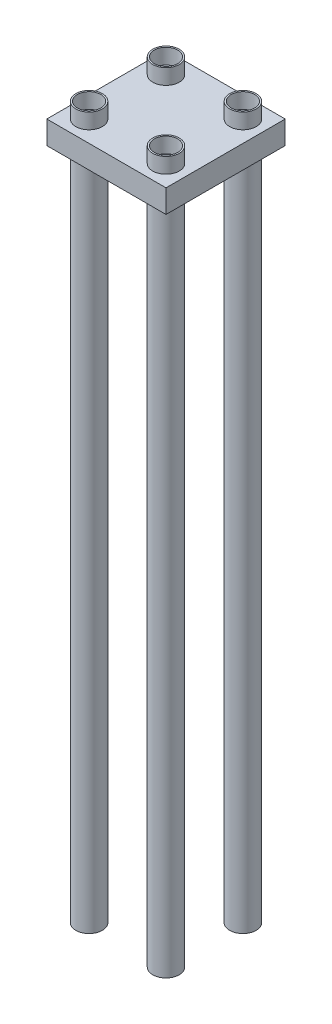
ISO-10303-21;
HEADER;
FILE_DESCRIPTION(('STEP AP214'),'2;1');
FILE_NAME('part.step','',(''),(''),'','','');
FILE_SCHEMA(('AUTOMOTIVE_DESIGN { 1 0 10303 214 1 1 1 1 }'));
ENDSEC;
DATA;
#1=APPLICATION_CONTEXT('core data for automotive mechanical design processes');
#2=APPLICATION_PROTOCOL_DEFINITION('international standard','automotive_design',2000,#1);
#3=PRODUCT_CONTEXT('',#1,'mechanical');
#4=PRODUCT('Part','Part','',(#3));
#5=PRODUCT_RELATED_PRODUCT_CATEGORY('part','',(#4));
#6=PRODUCT_DEFINITION_FORMATION('','',#4);
#7=PRODUCT_DEFINITION_CONTEXT('part definition',#1,'design');
#8=PRODUCT_DEFINITION('design','',#6,#7);
#9=PRODUCT_DEFINITION_SHAPE('','',#8);
#10=(LENGTH_UNIT() NAMED_UNIT(*) SI_UNIT(.MILLI.,.METRE.));
#11=(NAMED_UNIT(*) PLANE_ANGLE_UNIT() SI_UNIT($,.RADIAN.));
#12=(NAMED_UNIT(*) SI_UNIT($,.STERADIAN.) SOLID_ANGLE_UNIT());
#13=UNCERTAINTY_MEASURE_WITH_UNIT(LENGTH_MEASURE(1.E-05),#10,'distance_accuracy_value','');
#14=(GEOMETRIC_REPRESENTATION_CONTEXT(3) GLOBAL_UNCERTAINTY_ASSIGNED_CONTEXT((#13)) GLOBAL_UNIT_ASSIGNED_CONTEXT((#10,
#11,#12)) REPRESENTATION_CONTEXT('',''));
#15=CARTESIAN_POINT('',(0.,0.,0.));
#16=DIRECTION('',(0.,0.,1.));
#17=DIRECTION('',(1.,0.,0.));
#18=AXIS2_PLACEMENT_3D('',#15,#16,#17);
#19=CARTESIAN_POINT('',(1550.,500.,1500.));
#20=DIRECTION('',(-1.,0.,0.));
#21=DIRECTION('',(0.,0.,1.));
#22=AXIS2_PLACEMENT_3D('',#19,#20,#21);
#23=PLANE('',#22);
#24=DIRECTION('',(0.,0.,-1.));
#25=VECTOR('',#24,1.);
#26=CARTESIAN_POINT('',(1550.,-50.,0.));
#27=LINE('',#26,#25);
#28=CARTESIAN_POINT('',(1550.,-50.,1550.));
#29=VERTEX_POINT('',#28);
#30=CARTESIAN_POINT('',(1550.,-50.,-1550.));
#31=VERTEX_POINT('',#30);
#32=EDGE_CURVE('E132',#29,#31,#27,.T.);
#33=ORIENTED_EDGE('',*,*,#32,.T.);
#34=DIRECTION('',(0.,-1.,0.));
#35=VECTOR('',#34,1.);
#36=CARTESIAN_POINT('',(1550.,500.,-1550.));
#37=LINE('',#36,#35);
#38=CARTESIAN_POINT('',(1550.,550.,-1550.));
#39=VERTEX_POINT('',#38);
#40=EDGE_CURVE('E135',#39,#31,#37,.T.);
#41=ORIENTED_EDGE('',*,*,#40,.F.);
#42=DIRECTION('',(0.,0.,-1.));
#43=VECTOR('',#42,1.);
#44=CARTESIAN_POINT('',(1550.,550.,0.));
#45=LINE('',#44,#43);
#46=CARTESIAN_POINT('',(1550.,550.,1550.));
#47=VERTEX_POINT('',#46);
#48=EDGE_CURVE('E152',#47,#39,#45,.T.);
#49=ORIENTED_EDGE('',*,*,#48,.F.);
#50=DIRECTION('',(0.,-1.,0.));
#51=VECTOR('',#50,1.);
#52=CARTESIAN_POINT('',(1550.,500.,1550.));
#53=LINE('',#52,#51);
#54=EDGE_CURVE('E143',#47,#29,#53,.T.);
#55=ORIENTED_EDGE('',*,*,#54,.T.);
#56=EDGE_LOOP('',(#33,#41,#49,#55));
#57=FACE_BOUND('',#56,.T.);
#58=ADVANCED_FACE('F38',(#57),#23,.F.);
#59=CARTESIAN_POINT('',(-1500.,500.,-1550.));
#60=DIRECTION('',(0.,0.,1.));
#61=DIRECTION('',(1.,0.,0.));
#62=AXIS2_PLACEMENT_3D('',#59,#60,#61);
#63=PLANE('',#62);
#64=DIRECTION('',(-1.,0.,0.));
#65=VECTOR('',#64,1.);
#66=CARTESIAN_POINT('',(0.,-50.,-1550.));
#67=LINE('',#66,#65);
#68=CARTESIAN_POINT('',(-1550.,-50.,-1550.));
#69=VERTEX_POINT('',#68);
#70=EDGE_CURVE('E126',#31,#69,#67,.T.);
#71=ORIENTED_EDGE('',*,*,#70,.T.);
#72=DIRECTION('',(0.,-1.,0.));
#73=VECTOR('',#72,1.);
#74=CARTESIAN_POINT('',(-1550.,500.,-1550.));
#75=LINE('',#74,#73);
#76=CARTESIAN_POINT('',(-1550.,550.,-1550.));
#77=VERTEX_POINT('',#76);
#78=EDGE_CURVE('E141',#77,#69,#75,.T.);
#79=ORIENTED_EDGE('',*,*,#78,.F.);
#80=DIRECTION('',(-1.,0.,0.));
#81=VECTOR('',#80,1.);
#82=CARTESIAN_POINT('',(0.,550.,-1550.));
#83=LINE('',#82,#81);
#84=EDGE_CURVE('E137',#39,#77,#83,.T.);
#85=ORIENTED_EDGE('',*,*,#84,.F.);
#86=ORIENTED_EDGE('',*,*,#40,.T.);
#87=EDGE_LOOP('',(#71,#79,#85,#86));
#88=FACE_BOUND('',#87,.T.);
#89=ADVANCED_FACE('F136',(#88),#63,.F.);
#90=CARTESIAN_POINT('',(-1550.,500.,1500.));
#91=DIRECTION('',(1.,0.,0.));
#92=DIRECTION('',(0.,0.,-1.));
#93=AXIS2_PLACEMENT_3D('',#90,#91,#92);
#94=PLANE('',#93);
#95=DIRECTION('',(0.,0.,1.));
#96=VECTOR('',#95,1.);
#97=CARTESIAN_POINT('',(-1550.,-50.,0.));
#98=LINE('',#97,#96);
#99=CARTESIAN_POINT('',(-1550.,-50.,1550.));
#100=VERTEX_POINT('',#99);
#101=EDGE_CURVE('E118',#69,#100,#98,.T.);
#102=ORIENTED_EDGE('',*,*,#101,.T.);
#103=DIRECTION('',(0.,-1.,0.));
#104=VECTOR('',#103,1.);
#105=CARTESIAN_POINT('',(-1550.,500.,1550.));
#106=LINE('',#105,#104);
#107=CARTESIAN_POINT('',(-1550.,550.,1550.));
#108=VERTEX_POINT('',#107);
#109=EDGE_CURVE('E154',#108,#100,#106,.T.);
#110=ORIENTED_EDGE('',*,*,#109,.F.);
#111=DIRECTION('',(0.,0.,1.));
#112=VECTOR('',#111,1.);
#113=CARTESIAN_POINT('',(-1550.,550.,0.));
#114=LINE('',#113,#112);
#115=EDGE_CURVE('E98',#77,#108,#114,.T.);
#116=ORIENTED_EDGE('',*,*,#115,.F.);
#117=ORIENTED_EDGE('',*,*,#78,.T.);
#118=EDGE_LOOP('',(#102,#110,#116,#117));
#119=FACE_BOUND('',#118,.T.);
#120=ADVANCED_FACE('F383',(#119),#94,.F.);
#121=CARTESIAN_POINT('',(-1500.,500.,1550.));
#122=DIRECTION('',(0.,0.,-1.));
#123=DIRECTION('',(-1.,0.,0.));
#124=AXIS2_PLACEMENT_3D('',#121,#122,#123);
#125=PLANE('',#124);
#126=DIRECTION('',(1.,0.,0.));
#127=VECTOR('',#126,1.);
#128=CARTESIAN_POINT('',(0.,-50.,1550.));
#129=LINE('',#128,#127);
#130=EDGE_CURVE('E109',#100,#29,#129,.T.);
#131=ORIENTED_EDGE('',*,*,#130,.T.);
#132=ORIENTED_EDGE('',*,*,#54,.F.);
#133=DIRECTION('',(1.,0.,0.));
#134=VECTOR('',#133,1.);
#135=CARTESIAN_POINT('',(0.,550.,1550.));
#136=LINE('',#135,#134);
#137=EDGE_CURVE('E92',#108,#47,#136,.T.);
#138=ORIENTED_EDGE('',*,*,#137,.F.);
#139=ORIENTED_EDGE('',*,*,#109,.T.);
#140=EDGE_LOOP('',(#131,#132,#138,#139));
#141=FACE_BOUND('',#140,.T.);
#142=ADVANCED_FACE('F377',(#141),#125,.F.);
#143=CARTESIAN_POINT('',(0.,550.,0.));
#144=DIRECTION('',(0.,-1.,0.));
#145=DIRECTION('',(0.,0.,-1.));
#146=AXIS2_PLACEMENT_3D('',#143,#144,#145);
#147=PLANE('',#146);
#148=CARTESIAN_POINT('',(1000.,550.000000000001,1000.));
#149=DIRECTION('',(0.,-1.,0.));
#150=DIRECTION('',(0.,0.,-1.));
#151=AXIS2_PLACEMENT_3D('',#148,#149,#150);
#152=CIRCLE('',#151,345.);
#153=CARTESIAN_POINT('',(1000.,550.000000000001,655.));
#154=VERTEX_POINT('',#153);
#155=EDGE_CURVE('E11',#154,#154,#152,.F.);
#156=ORIENTED_EDGE('',*,*,#155,.F.);
#157=EDGE_LOOP('',(#156));
#158=FACE_BOUND('',#157,.T.);
#159=CARTESIAN_POINT('',(1000.,550.000000000001,-1000.));
#160=DIRECTION('',(0.,-1.,0.));
#161=DIRECTION('',(0.,0.,-1.));
#162=AXIS2_PLACEMENT_3D('',#159,#160,#161);
#163=CIRCLE('',#162,345.);
#164=CARTESIAN_POINT('',(1000.,550.000000000001,-1345.));
#165=VERTEX_POINT('',#164);
#166=EDGE_CURVE('E260',#165,#165,#163,.F.);
#167=ORIENTED_EDGE('',*,*,#166,.F.);
#168=EDGE_LOOP('',(#167));
#169=FACE_BOUND('',#168,.T.);
#170=CARTESIAN_POINT('',(-1000.,550.000000000001,1000.));
#171=DIRECTION('',(0.,-1.,0.));
#172=DIRECTION('',(0.,0.,-1.));
#173=AXIS2_PLACEMENT_3D('',#170,#171,#172);
#174=CIRCLE('',#173,345.);
#175=CARTESIAN_POINT('',(-1000.,550.000000000001,655.));
#176=VERTEX_POINT('',#175);
#177=EDGE_CURVE('E212',#176,#176,#174,.F.);
#178=ORIENTED_EDGE('',*,*,#177,.F.);
#179=EDGE_LOOP('',(#178));
#180=FACE_BOUND('',#179,.T.);
#181=CARTESIAN_POINT('',(-1000.,550.000000000001,-1000.));
#182=DIRECTION('',(0.,-1.,0.));
#183=DIRECTION('',(0.,0.,-1.));
#184=AXIS2_PLACEMENT_3D('',#181,#182,#183);
#185=CIRCLE('',#184,345.);
#186=CARTESIAN_POINT('',(-1000.,550.000000000001,-1345.));
#187=VERTEX_POINT('',#186);
#188=EDGE_CURVE('E150',#187,#187,#185,.F.);
#189=ORIENTED_EDGE('',*,*,#188,.F.);
#190=EDGE_LOOP('',(#189));
#191=FACE_BOUND('',#190,.T.);
#192=ORIENTED_EDGE('',*,*,#48,.T.);
#193=ORIENTED_EDGE('',*,*,#84,.T.);
#194=ORIENTED_EDGE('',*,*,#115,.T.);
#195=ORIENTED_EDGE('',*,*,#137,.T.);
#196=EDGE_LOOP('',(#192,#193,#194,#195));
#197=FACE_BOUND('',#196,.T.);
#198=ADVANCED_FACE('F371',(#158,#169,#180,#191,#197),#147,.F.);
#199=CARTESIAN_POINT('',(0.,-50.,0.));
#200=DIRECTION('',(0.,-1.,0.));
#201=DIRECTION('',(0.,0.,-1.));
#202=AXIS2_PLACEMENT_3D('',#199,#200,#201);
#203=PLANE('',#202);
#204=CARTESIAN_POINT('',(1000.,-50.0000000000007,1000.));
#205=DIRECTION('',(0.,-1.,0.));
#206=DIRECTION('',(0.,0.,-1.));
#207=AXIS2_PLACEMENT_3D('',#204,#205,#206);
#208=CIRCLE('',#207,345.);
#209=CARTESIAN_POINT('',(1000.,-50.0000000000007,655.));
#210=VERTEX_POINT('',#209);
#211=EDGE_CURVE('E241',#210,#210,#208,.F.);
#212=ORIENTED_EDGE('',*,*,#211,.T.);
#213=EDGE_LOOP('',(#212));
#214=FACE_BOUND('',#213,.T.);
#215=CARTESIAN_POINT('',(1000.,-50.0000000000007,-1000.));
#216=DIRECTION('',(0.,-1.,0.));
#217=DIRECTION('',(0.,0.,-1.));
#218=AXIS2_PLACEMENT_3D('',#215,#216,#217);
#219=CIRCLE('',#218,345.);
#220=CARTESIAN_POINT('',(1000.,-50.0000000000007,-1345.));
#221=VERTEX_POINT('',#220);
#222=EDGE_CURVE('E266',#221,#221,#219,.F.);
#223=ORIENTED_EDGE('',*,*,#222,.T.);
#224=EDGE_LOOP('',(#223));
#225=FACE_BOUND('',#224,.T.);
#226=CARTESIAN_POINT('',(-1000.,-50.0000000000007,1000.));
#227=DIRECTION('',(0.,-1.,0.));
#228=DIRECTION('',(0.,0.,-1.));
#229=AXIS2_PLACEMENT_3D('',#226,#227,#228);
#230=CIRCLE('',#229,345.);
#231=CARTESIAN_POINT('',(-1000.,-50.0000000000007,655.));
#232=VERTEX_POINT('',#231);
#233=EDGE_CURVE('E292',#232,#232,#230,.F.);
#234=ORIENTED_EDGE('',*,*,#233,.T.);
#235=EDGE_LOOP('',(#234));
#236=FACE_BOUND('',#235,.T.);
#237=CARTESIAN_POINT('',(-1000.,-50.0000000000007,-1000.));
#238=DIRECTION('',(0.,-1.,0.));
#239=DIRECTION('',(0.,0.,-1.));
#240=AXIS2_PLACEMENT_3D('',#237,#238,#239);
#241=CIRCLE('',#240,345.);
#242=CARTESIAN_POINT('',(-1000.,-50.0000000000007,-1345.));
#243=VERTEX_POINT('',#242);
#244=EDGE_CURVE('E144',#243,#243,#241,.F.);
#245=ORIENTED_EDGE('',*,*,#244,.T.);
#246=EDGE_LOOP('',(#245));
#247=FACE_BOUND('',#246,.T.);
#248=ORIENTED_EDGE('',*,*,#32,.F.);
#249=ORIENTED_EDGE('',*,*,#130,.F.);
#250=ORIENTED_EDGE('',*,*,#101,.F.);
#251=ORIENTED_EDGE('',*,*,#70,.F.);
#252=EDGE_LOOP('',(#248,#249,#250,#251));
#253=FACE_BOUND('',#252,.T.);
#254=ADVANCED_FACE('F130',(#214,#225,#236,#247,#253),#203,.T.);
#255=CARTESIAN_POINT('',(-1000.,-17550.,-1000.));
#256=DIRECTION('',(0.,1.,0.));
#257=DIRECTION('',(0.,0.,1.));
#258=AXIS2_PLACEMENT_3D('',#255,#256,#257);
#259=CYLINDRICAL_SURFACE('',#258,345.);
#260=ORIENTED_EDGE('',*,*,#244,.F.);
#261=EDGE_LOOP('',(#260));
#262=FACE_BOUND('',#261,.T.);
#263=CARTESIAN_POINT('',(-1000.,-17550.,-1000.));
#264=DIRECTION('',(0.,-1.,0.));
#265=DIRECTION('',(0.,0.,-1.));
#266=AXIS2_PLACEMENT_3D('',#263,#264,#265);
#267=CIRCLE('',#266,345.);
#268=CARTESIAN_POINT('',(-1000.,-17550.,-1345.));
#269=VERTEX_POINT('',#268);
#270=EDGE_CURVE('E191',#269,#269,#267,.T.);
#271=ORIENTED_EDGE('',*,*,#270,.F.);
#272=EDGE_LOOP('',(#271));
#273=FACE_BOUND('',#272,.T.);
#274=ADVANCED_FACE('F326',(#262,#273),#259,.T.);
#275=CARTESIAN_POINT('',(-1000.,-17550.,-1000.));
#276=DIRECTION('',(0.,-1.,0.));
#277=DIRECTION('',(0.,0.,-1.));
#278=AXIS2_PLACEMENT_3D('',#275,#276,#277);
#279=PLANE('',#278);
#280=ORIENTED_EDGE('',*,*,#270,.T.);
#281=EDGE_LOOP('',(#280));
#282=FACE_BOUND('',#281,.T.);
#283=CARTESIAN_POINT('',(-1000.,-17550.,-1000.));
#284=DIRECTION('',(0.,-1.,0.));
#285=DIRECTION('',(0.,0.,-1.));
#286=AXIS2_PLACEMENT_3D('',#283,#284,#285);
#287=CIRCLE('',#286,305.);
#288=CARTESIAN_POINT('',(-1000.,-17550.,-1305.));
#289=VERTEX_POINT('',#288);
#290=EDGE_CURVE('E298',#289,#289,#287,.T.);
#291=ORIENTED_EDGE('',*,*,#290,.F.);
#292=EDGE_LOOP('',(#291));
#293=FACE_BOUND('',#292,.T.);
#294=ADVANCED_FACE('F391',(#282,#293),#279,.T.);
#295=CARTESIAN_POINT('',(-1000.,-17550.,-1000.));
#296=DIRECTION('',(0.,1.,0.));
#297=DIRECTION('',(0.,0.,1.));
#298=AXIS2_PLACEMENT_3D('',#295,#296,#297);
#299=CYLINDRICAL_SURFACE('',#298,305.);
#300=CARTESIAN_POINT('',(-1000.,-50.0000000000007,-1000.));
#301=DIRECTION('',(0.,-1.,0.));
#302=DIRECTION('',(0.,0.,-1.));
#303=AXIS2_PLACEMENT_3D('',#300,#301,#302);
#304=CIRCLE('',#303,305.);
#305=CARTESIAN_POINT('',(-1000.,-50.0000000000007,-1305.));
#306=VERTEX_POINT('',#305);
#307=EDGE_CURVE('E310',#306,#306,#304,.F.);
#308=ORIENTED_EDGE('',*,*,#307,.T.);
#309=EDGE_LOOP('',(#308));
#310=FACE_BOUND('',#309,.T.);
#311=ORIENTED_EDGE('',*,*,#290,.T.);
#312=EDGE_LOOP('',(#311));
#313=FACE_BOUND('',#312,.T.);
#314=ADVANCED_FACE('F400',(#310,#313),#299,.F.);
#315=ORIENTED_EDGE('',*,*,#307,.F.);
#316=EDGE_LOOP('',(#315));
#317=FACE_BOUND('',#316,.T.);
#318=ADVANCED_FACE('F374',(#317),#203,.T.);
#319=CARTESIAN_POINT('',(-1000.,949.999999999999,-1000.));
#320=DIRECTION('',(0.,-1.,0.));
#321=DIRECTION('',(0.,0.,-1.));
#322=AXIS2_PLACEMENT_3D('',#319,#320,#321);
#323=CIRCLE('',#322,345.);
#324=CARTESIAN_POINT('',(-1000.,949.999999999999,-1345.));
#325=VERTEX_POINT('',#324);
#326=EDGE_CURVE('E301',#325,#325,#323,.T.);
#327=ORIENTED_EDGE('',*,*,#326,.T.);
#328=EDGE_LOOP('',(#327));
#329=FACE_BOUND('',#328,.T.);
#330=ORIENTED_EDGE('',*,*,#188,.T.);
#331=EDGE_LOOP('',(#330));
#332=FACE_BOUND('',#331,.T.);
#333=ADVANCED_FACE('F327',(#329,#332),#259,.T.);
#334=CARTESIAN_POINT('',(-1000.,949.999999999999,-1000.));
#335=DIRECTION('',(0.,-1.,0.));
#336=DIRECTION('',(0.,0.,-1.));
#337=AXIS2_PLACEMENT_3D('',#334,#335,#336);
#338=CIRCLE('',#337,305.);
#339=CARTESIAN_POINT('',(-1000.,949.999999999999,-1305.));
#340=VERTEX_POINT('',#339);
#341=EDGE_CURVE('E295',#340,#340,#338,.T.);
#342=ORIENTED_EDGE('',*,*,#341,.F.);
#343=EDGE_LOOP('',(#342));
#344=FACE_BOUND('',#343,.T.);
#345=CARTESIAN_POINT('',(-1000.,550.000000000001,-1000.));
#346=DIRECTION('',(0.,-1.,0.));
#347=DIRECTION('',(0.,0.,-1.));
#348=AXIS2_PLACEMENT_3D('',#345,#346,#347);
#349=CIRCLE('',#348,305.);
#350=CARTESIAN_POINT('',(-1000.,550.000000000001,-1305.));
#351=VERTEX_POINT('',#350);
#352=EDGE_CURVE('E190',#351,#351,#349,.F.);
#353=ORIENTED_EDGE('',*,*,#352,.F.);
#354=EDGE_LOOP('',(#353));
#355=FACE_BOUND('',#354,.T.);
#356=ADVANCED_FACE('F396',(#344,#355),#299,.F.);
#357=CARTESIAN_POINT('',(-1000.,950.,-1000.));
#358=DIRECTION('',(0.,-1.,0.));
#359=DIRECTION('',(0.,0.,-1.));
#360=AXIS2_PLACEMENT_3D('',#357,#358,#359);
#361=PLANE('',#360);
#362=ORIENTED_EDGE('',*,*,#326,.F.);
#363=EDGE_LOOP('',(#362));
#364=FACE_BOUND('',#363,.T.);
#365=ORIENTED_EDGE('',*,*,#341,.T.);
#366=EDGE_LOOP('',(#365));
#367=FACE_BOUND('',#366,.T.);
#368=ADVANCED_FACE('F393',(#364,#367),#361,.F.);
#369=ORIENTED_EDGE('',*,*,#352,.T.);
#370=EDGE_LOOP('',(#369));
#371=FACE_BOUND('',#370,.T.);
#372=ADVANCED_FACE('F380',(#371),#147,.F.);
#373=CARTESIAN_POINT('',(-1000.,-17550.,999.999999999998));
#374=DIRECTION('',(0.,1.,0.));
#375=DIRECTION('',(0.,0.,1.));
#376=AXIS2_PLACEMENT_3D('',#373,#374,#375);
#377=CYLINDRICAL_SURFACE('',#376,345.);
#378=ORIENTED_EDGE('',*,*,#233,.F.);
#379=EDGE_LOOP('',(#378));
#380=FACE_BOUND('',#379,.T.);
#381=CARTESIAN_POINT('',(-1000.,-17550.,999.999999999998));
#382=DIRECTION('',(0.,-1.,0.));
#383=DIRECTION('',(0.,0.,-1.));
#384=AXIS2_PLACEMENT_3D('',#381,#382,#383);
#385=CIRCLE('',#384,345.);
#386=CARTESIAN_POINT('',(-1000.,-17550.,654.999999999998));
#387=VERTEX_POINT('',#386);
#388=EDGE_CURVE('E199',#387,#387,#385,.T.);
#389=ORIENTED_EDGE('',*,*,#388,.F.);
#390=EDGE_LOOP('',(#389));
#391=FACE_BOUND('',#390,.T.);
#392=ADVANCED_FACE('F406',(#380,#391),#377,.T.);
#393=CARTESIAN_POINT('',(-1000.,-17550.,999.999999999998));
#394=DIRECTION('',(0.,-1.,0.));
#395=DIRECTION('',(0.,0.,-1.));
#396=AXIS2_PLACEMENT_3D('',#393,#394,#395);
#397=PLANE('',#396);
#398=ORIENTED_EDGE('',*,*,#388,.T.);
#399=EDGE_LOOP('',(#398));
#400=FACE_BOUND('',#399,.T.);
#401=CARTESIAN_POINT('',(-1000.,-17550.,999.999999999998));
#402=DIRECTION('',(0.,-1.,0.));
#403=DIRECTION('',(0.,0.,-1.));
#404=AXIS2_PLACEMENT_3D('',#401,#402,#403);
#405=CIRCLE('',#404,305.);
#406=CARTESIAN_POINT('',(-1000.,-17550.,694.999999999998));
#407=VERTEX_POINT('',#406);
#408=EDGE_CURVE('E272',#407,#407,#405,.T.);
#409=ORIENTED_EDGE('',*,*,#408,.F.);
#410=EDGE_LOOP('',(#409));
#411=FACE_BOUND('',#410,.T.);
#412=ADVANCED_FACE('F409',(#400,#411),#397,.T.);
#413=CARTESIAN_POINT('',(-1000.,-17550.,999.999999999998));
#414=DIRECTION('',(0.,1.,0.));
#415=DIRECTION('',(0.,0.,1.));
#416=AXIS2_PLACEMENT_3D('',#413,#414,#415);
#417=CYLINDRICAL_SURFACE('',#416,305.);
#418=CARTESIAN_POINT('',(-1000.,-50.0000000000007,1000.));
#419=DIRECTION('',(0.,-1.,0.));
#420=DIRECTION('',(0.,0.,-1.));
#421=AXIS2_PLACEMENT_3D('',#418,#419,#420);
#422=CIRCLE('',#421,305.);
#423=CARTESIAN_POINT('',(-1000.,-50.0000000000007,695.));
#424=VERTEX_POINT('',#423);
#425=EDGE_CURVE('E284',#424,#424,#422,.F.);
#426=ORIENTED_EDGE('',*,*,#425,.T.);
#427=EDGE_LOOP('',(#426));
#428=FACE_BOUND('',#427,.T.);
#429=ORIENTED_EDGE('',*,*,#408,.T.);
#430=EDGE_LOOP('',(#429));
#431=FACE_BOUND('',#430,.T.);
#432=ADVANCED_FACE('F420',(#428,#431),#417,.F.);
#433=ORIENTED_EDGE('',*,*,#425,.F.);
#434=EDGE_LOOP('',(#433));
#435=FACE_BOUND('',#434,.T.);
#436=ADVANCED_FACE('F424',(#435),#203,.T.);
#437=CARTESIAN_POINT('',(-1000.,949.999999999999,1000.));
#438=DIRECTION('',(0.,-1.,0.));
#439=DIRECTION('',(0.,0.,-1.));
#440=AXIS2_PLACEMENT_3D('',#437,#438,#439);
#441=CIRCLE('',#440,345.);
#442=CARTESIAN_POINT('',(-1000.,949.999999999999,655.));
#443=VERTEX_POINT('',#442);
#444=EDGE_CURVE('E275',#443,#443,#441,.T.);
#445=ORIENTED_EDGE('',*,*,#444,.T.);
#446=EDGE_LOOP('',(#445));
#447=FACE_BOUND('',#446,.T.);
#448=ORIENTED_EDGE('',*,*,#177,.T.);
#449=EDGE_LOOP('',(#448));
#450=FACE_BOUND('',#449,.T.);
#451=ADVANCED_FACE('F411',(#447,#450),#377,.T.);
#452=CARTESIAN_POINT('',(-1000.,949.999999999999,1000.));
#453=DIRECTION('',(0.,-1.,0.));
#454=DIRECTION('',(0.,0.,-1.));
#455=AXIS2_PLACEMENT_3D('',#452,#453,#454);
#456=CIRCLE('',#455,305.);
#457=CARTESIAN_POINT('',(-1000.,949.999999999999,695.));
#458=VERTEX_POINT('',#457);
#459=EDGE_CURVE('E269',#458,#458,#456,.T.);
#460=ORIENTED_EDGE('',*,*,#459,.F.);
#461=EDGE_LOOP('',(#460));
#462=FACE_BOUND('',#461,.T.);
#463=CARTESIAN_POINT('',(-1000.,550.000000000001,1000.));
#464=DIRECTION('',(0.,-1.,0.));
#465=DIRECTION('',(0.,0.,-1.));
#466=AXIS2_PLACEMENT_3D('',#463,#464,#465);
#467=CIRCLE('',#466,305.);
#468=CARTESIAN_POINT('',(-1000.,550.000000000001,695.));
#469=VERTEX_POINT('',#468);
#470=EDGE_CURVE('E198',#469,#469,#467,.F.);
#471=ORIENTED_EDGE('',*,*,#470,.F.);
#472=EDGE_LOOP('',(#471));
#473=FACE_BOUND('',#472,.T.);
#474=ADVANCED_FACE('F416',(#462,#473),#417,.F.);
#475=CARTESIAN_POINT('',(-1000.,950.,1000.));
#476=DIRECTION('',(0.,-1.,0.));
#477=DIRECTION('',(0.,0.,-1.));
#478=AXIS2_PLACEMENT_3D('',#475,#476,#477);
#479=PLANE('',#478);
#480=ORIENTED_EDGE('',*,*,#444,.F.);
#481=EDGE_LOOP('',(#480));
#482=FACE_BOUND('',#481,.T.);
#483=ORIENTED_EDGE('',*,*,#459,.T.);
#484=EDGE_LOOP('',(#483));
#485=FACE_BOUND('',#484,.T.);
#486=ADVANCED_FACE('F412',(#482,#485),#479,.F.);
#487=ORIENTED_EDGE('',*,*,#470,.T.);
#488=EDGE_LOOP('',(#487));
#489=FACE_BOUND('',#488,.T.);
#490=ADVANCED_FACE('F415',(#489),#147,.F.);
#491=CARTESIAN_POINT('',(1000.,-17550.,-1000.));
#492=DIRECTION('',(0.,1.,0.));
#493=DIRECTION('',(0.,0.,1.));
#494=AXIS2_PLACEMENT_3D('',#491,#492,#493);
#495=CYLINDRICAL_SURFACE('',#494,345.);
#496=ORIENTED_EDGE('',*,*,#222,.F.);
#497=EDGE_LOOP('',(#496));
#498=FACE_BOUND('',#497,.T.);
#499=CARTESIAN_POINT('',(1000.,-17550.,-1000.));
#500=DIRECTION('',(0.,-1.,0.));
#501=DIRECTION('',(0.,0.,-1.));
#502=AXIS2_PLACEMENT_3D('',#499,#500,#501);
#503=CIRCLE('',#502,345.);
#504=CARTESIAN_POINT('',(1000.,-17550.,-1345.));
#505=VERTEX_POINT('',#504);
#506=EDGE_CURVE('E208',#505,#505,#503,.T.);
#507=ORIENTED_EDGE('',*,*,#506,.F.);
#508=EDGE_LOOP('',(#507));
#509=FACE_BOUND('',#508,.T.);
#510=ADVANCED_FACE('F427',(#498,#509),#495,.T.);
#511=CARTESIAN_POINT('',(1000.,-17550.,-1000.));
#512=DIRECTION('',(0.,-1.,0.));
#513=DIRECTION('',(0.,0.,-1.));
#514=AXIS2_PLACEMENT_3D('',#511,#512,#513);
#515=PLANE('',#514);
#516=ORIENTED_EDGE('',*,*,#506,.T.);
#517=EDGE_LOOP('',(#516));
#518=FACE_BOUND('',#517,.T.);
#519=CARTESIAN_POINT('',(1000.,-17550.,-1000.));
#520=DIRECTION('',(0.,-1.,0.));
#521=DIRECTION('',(0.,0.,-1.));
#522=AXIS2_PLACEMENT_3D('',#519,#520,#521);
#523=CIRCLE('',#522,305.);
#524=CARTESIAN_POINT('',(1000.,-17550.,-1305.));
#525=VERTEX_POINT('',#524);
#526=EDGE_CURVE('E245',#525,#525,#523,.T.);
#527=ORIENTED_EDGE('',*,*,#526,.F.);
#528=EDGE_LOOP('',(#527));
#529=FACE_BOUND('',#528,.T.);
#530=ADVANCED_FACE('F430',(#518,#529),#515,.T.);
#531=CARTESIAN_POINT('',(1000.,-17550.,-1000.));
#532=DIRECTION('',(0.,1.,0.));
#533=DIRECTION('',(0.,0.,1.));
#534=AXIS2_PLACEMENT_3D('',#531,#532,#533);
#535=CYLINDRICAL_SURFACE('',#534,305.);
#536=CARTESIAN_POINT('',(1000.,-50.0000000000007,-1000.));
#537=DIRECTION('',(0.,-1.,0.));
#538=DIRECTION('',(0.,0.,-1.));
#539=AXIS2_PLACEMENT_3D('',#536,#537,#538);
#540=CIRCLE('',#539,305.);
#541=CARTESIAN_POINT('',(1000.,-50.0000000000007,-1305.));
#542=VERTEX_POINT('',#541);
#543=EDGE_CURVE('E257',#542,#542,#540,.F.);
#544=ORIENTED_EDGE('',*,*,#543,.T.);
#545=EDGE_LOOP('',(#544));
#546=FACE_BOUND('',#545,.T.);
#547=ORIENTED_EDGE('',*,*,#526,.T.);
#548=EDGE_LOOP('',(#547));
#549=FACE_BOUND('',#548,.T.);
#550=ADVANCED_FACE('F442',(#546,#549),#535,.F.);
#551=ORIENTED_EDGE('',*,*,#543,.F.);
#552=EDGE_LOOP('',(#551));
#553=FACE_BOUND('',#552,.T.);
#554=ADVANCED_FACE('F446',(#553),#203,.T.);
#555=CARTESIAN_POINT('',(1000.,949.999999999999,-1000.));
#556=DIRECTION('',(0.,-1.,0.));
#557=DIRECTION('',(0.,0.,-1.));
#558=AXIS2_PLACEMENT_3D('',#555,#556,#557);
#559=CIRCLE('',#558,345.);
#560=CARTESIAN_POINT('',(1000.,949.999999999999,-1345.));
#561=VERTEX_POINT('',#560);
#562=EDGE_CURVE('E248',#561,#561,#559,.T.);
#563=ORIENTED_EDGE('',*,*,#562,.T.);
#564=EDGE_LOOP('',(#563));
#565=FACE_BOUND('',#564,.T.);
#566=ORIENTED_EDGE('',*,*,#166,.T.);
#567=EDGE_LOOP('',(#566));
#568=FACE_BOUND('',#567,.T.);
#569=ADVANCED_FACE('F432',(#565,#568),#495,.T.);
#570=CARTESIAN_POINT('',(1000.,949.999999999999,-1000.));
#571=DIRECTION('',(0.,-1.,0.));
#572=DIRECTION('',(0.,0.,-1.));
#573=AXIS2_PLACEMENT_3D('',#570,#571,#572);
#574=CIRCLE('',#573,305.);
#575=CARTESIAN_POINT('',(1000.,949.999999999999,-1305.));
#576=VERTEX_POINT('',#575);
#577=EDGE_CURVE('E243',#576,#576,#574,.T.);
#578=ORIENTED_EDGE('',*,*,#577,.F.);
#579=EDGE_LOOP('',(#578));
#580=FACE_BOUND('',#579,.T.);
#581=CARTESIAN_POINT('',(1000.,550.000000000001,-1000.));
#582=DIRECTION('',(0.,-1.,0.));
#583=DIRECTION('',(0.,0.,-1.));
#584=AXIS2_PLACEMENT_3D('',#581,#582,#583);
#585=CIRCLE('',#584,305.);
#586=CARTESIAN_POINT('',(1000.,550.000000000001,-1305.));
#587=VERTEX_POINT('',#586);
#588=EDGE_CURVE('E207',#587,#587,#585,.F.);
#589=ORIENTED_EDGE('',*,*,#588,.F.);
#590=EDGE_LOOP('',(#589));
#591=FACE_BOUND('',#590,.T.);
#592=ADVANCED_FACE('F438',(#580,#591),#535,.F.);
#593=CARTESIAN_POINT('',(1000.,950.,-1000.));
#594=DIRECTION('',(0.,-1.,0.));
#595=DIRECTION('',(0.,0.,-1.));
#596=AXIS2_PLACEMENT_3D('',#593,#594,#595);
#597=PLANE('',#596);
#598=ORIENTED_EDGE('',*,*,#562,.F.);
#599=EDGE_LOOP('',(#598));
#600=FACE_BOUND('',#599,.T.);
#601=ORIENTED_EDGE('',*,*,#577,.T.);
#602=EDGE_LOOP('',(#601));
#603=FACE_BOUND('',#602,.T.);
#604=ADVANCED_FACE('F434',(#600,#603),#597,.F.);
#605=ORIENTED_EDGE('',*,*,#588,.T.);
#606=EDGE_LOOP('',(#605));
#607=FACE_BOUND('',#606,.T.);
#608=ADVANCED_FACE('F437',(#607),#147,.F.);
#609=CARTESIAN_POINT('',(1000.,-17550.,999.999999999998));
#610=DIRECTION('',(0.,1.,0.));
#611=DIRECTION('',(0.,0.,1.));
#612=AXIS2_PLACEMENT_3D('',#609,#610,#611);
#613=CYLINDRICAL_SURFACE('',#612,345.);
#614=ORIENTED_EDGE('',*,*,#211,.F.);
#615=EDGE_LOOP('',(#614));
#616=FACE_BOUND('',#615,.T.);
#617=CARTESIAN_POINT('',(1000.,-17550.,999.999999999998));
#618=DIRECTION('',(0.,-1.,0.));
#619=DIRECTION('',(0.,0.,-1.));
#620=AXIS2_PLACEMENT_3D('',#617,#618,#619);
#621=CIRCLE('',#620,345.);
#622=CARTESIAN_POINT('',(1000.,-17550.,654.999999999998));
#623=VERTEX_POINT('',#622);
#624=EDGE_CURVE('E216',#623,#623,#621,.T.);
#625=ORIENTED_EDGE('',*,*,#624,.F.);
#626=EDGE_LOOP('',(#625));
#627=FACE_BOUND('',#626,.T.);
#628=ADVANCED_FACE('F449',(#616,#627),#613,.T.);
#629=CARTESIAN_POINT('',(1000.,-17550.,999.999999999998));
#630=DIRECTION('',(0.,-1.,0.));
#631=DIRECTION('',(0.,0.,-1.));
#632=AXIS2_PLACEMENT_3D('',#629,#630,#631);
#633=PLANE('',#632);
#634=ORIENTED_EDGE('',*,*,#624,.T.);
#635=EDGE_LOOP('',(#634));
#636=FACE_BOUND('',#635,.T.);
#637=CARTESIAN_POINT('',(1000.,-17550.,999.999999999998));
#638=DIRECTION('',(0.,-1.,0.));
#639=DIRECTION('',(0.,0.,-1.));
#640=AXIS2_PLACEMENT_3D('',#637,#638,#639);
#641=CIRCLE('',#640,305.);
#642=CARTESIAN_POINT('',(1000.,-17550.,694.999999999998));
#643=VERTEX_POINT('',#642);
#644=EDGE_CURVE('E228',#643,#643,#641,.T.);
#645=ORIENTED_EDGE('',*,*,#644,.F.);
#646=EDGE_LOOP('',(#645));
#647=FACE_BOUND('',#646,.T.);
#648=ADVANCED_FACE('F452',(#636,#647),#633,.T.);
#649=CARTESIAN_POINT('',(1000.,-17550.,999.999999999998));
#650=DIRECTION('',(0.,1.,0.));
#651=DIRECTION('',(0.,0.,1.));
#652=AXIS2_PLACEMENT_3D('',#649,#650,#651);
#653=CYLINDRICAL_SURFACE('',#652,305.);
#654=CARTESIAN_POINT('',(1000.,-50.0000000000007,1000.));
#655=DIRECTION('',(0.,-1.,0.));
#656=DIRECTION('',(0.,0.,-1.));
#657=AXIS2_PLACEMENT_3D('',#654,#655,#656);
#658=CIRCLE('',#657,305.);
#659=CARTESIAN_POINT('',(1000.,-50.0000000000007,695.));
#660=VERTEX_POINT('',#659);
#661=EDGE_CURVE('E49',#660,#660,#658,.F.);
#662=ORIENTED_EDGE('',*,*,#661,.T.);
#663=EDGE_LOOP('',(#662));
#664=FACE_BOUND('',#663,.T.);
#665=ORIENTED_EDGE('',*,*,#644,.T.);
#666=EDGE_LOOP('',(#665));
#667=FACE_BOUND('',#666,.T.);
#668=ADVANCED_FACE('F463',(#664,#667),#653,.F.);
#669=ORIENTED_EDGE('',*,*,#661,.F.);
#670=EDGE_LOOP('',(#669));
#671=FACE_BOUND('',#670,.T.);
#672=ADVANCED_FACE('F373',(#671),#203,.T.);
#673=CARTESIAN_POINT('',(1000.,949.999999999999,1000.));
#674=DIRECTION('',(0.,-1.,0.));
#675=DIRECTION('',(0.,0.,-1.));
#676=AXIS2_PLACEMENT_3D('',#673,#674,#675);
#677=CIRCLE('',#676,345.);
#678=CARTESIAN_POINT('',(1000.,949.999999999999,655.));
#679=VERTEX_POINT('',#678);
#680=EDGE_CURVE('E223',#679,#679,#677,.T.);
#681=ORIENTED_EDGE('',*,*,#680,.T.);
#682=EDGE_LOOP('',(#681));
#683=FACE_BOUND('',#682,.T.);
#684=ORIENTED_EDGE('',*,*,#155,.T.);
#685=EDGE_LOOP('',(#684));
#686=FACE_BOUND('',#685,.T.);
#687=ADVANCED_FACE('F454',(#683,#686),#613,.T.);
#688=CARTESIAN_POINT('',(1000.,949.999999999999,1000.));
#689=DIRECTION('',(0.,-1.,0.));
#690=DIRECTION('',(0.,0.,-1.));
#691=AXIS2_PLACEMENT_3D('',#688,#689,#690);
#692=CIRCLE('',#691,305.);
#693=CARTESIAN_POINT('',(1000.,949.999999999999,695.));
#694=VERTEX_POINT('',#693);
#695=EDGE_CURVE('E231',#694,#694,#692,.T.);
#696=ORIENTED_EDGE('',*,*,#695,.F.);
#697=EDGE_LOOP('',(#696));
#698=FACE_BOUND('',#697,.T.);
#699=CARTESIAN_POINT('',(1000.,550.000000000001,1000.));
#700=DIRECTION('',(0.,-1.,0.));
#701=DIRECTION('',(0.,0.,-1.));
#702=AXIS2_PLACEMENT_3D('',#699,#700,#701);
#703=CIRCLE('',#702,305.);
#704=CARTESIAN_POINT('',(1000.,550.000000000001,695.));
#705=VERTEX_POINT('',#704);
#706=EDGE_CURVE('E215',#705,#705,#703,.F.);
#707=ORIENTED_EDGE('',*,*,#706,.F.);
#708=EDGE_LOOP('',(#707));
#709=FACE_BOUND('',#708,.T.);
#710=ADVANCED_FACE('F459',(#698,#709),#653,.F.);
#711=CARTESIAN_POINT('',(1000.,950.,1000.));
#712=DIRECTION('',(0.,-1.,0.));
#713=DIRECTION('',(0.,0.,-1.));
#714=AXIS2_PLACEMENT_3D('',#711,#712,#713);
#715=PLANE('',#714);
#716=ORIENTED_EDGE('',*,*,#680,.F.);
#717=EDGE_LOOP('',(#716));
#718=FACE_BOUND('',#717,.T.);
#719=ORIENTED_EDGE('',*,*,#695,.T.);
#720=EDGE_LOOP('',(#719));
#721=FACE_BOUND('',#720,.T.);
#722=ADVANCED_FACE('F456',(#718,#721),#715,.F.);
#723=ORIENTED_EDGE('',*,*,#706,.T.);
#724=EDGE_LOOP('',(#723));
#725=FACE_BOUND('',#724,.T.);
#726=ADVANCED_FACE('F379',(#725),#147,.F.);
#727=CLOSED_SHELL('',(#58,#89,#120,#142,#198,#254,#274,#294,#314,#318,#333,#356,#368,#372,#392,
#412,#432,#436,#451,#474,#486,#490,#510,#530,#550,#554,#569,#592,#604,#608,#628,#648,#668,#672,
#687,#710,#722,#726));
#728=CARTESIAN_POINT('',(0.,0.,0.));
#729=DIRECTION('',(0.,-1.,0.));
#730=DIRECTION('',(0.,0.,-1.));
#731=AXIS2_PLACEMENT_3D('',#728,#729,#730);
#732=PLANE('',#731);
#733=CARTESIAN_POINT('',(1000.,0.,1000.));
#734=DIRECTION('',(0.,-1.,0.));
#735=DIRECTION('',(0.,0.,-1.));
#736=AXIS2_PLACEMENT_3D('',#733,#734,#735);
#737=CIRCLE('',#736,305.);
#738=CARTESIAN_POINT('',(1000.,0.,695.));
#739=VERTEX_POINT('',#738);
#740=EDGE_CURVE('E213',#739,#739,#737,.F.);
#741=ORIENTED_EDGE('',*,*,#740,.T.);
#742=EDGE_LOOP('',(#741));
#743=FACE_BOUND('',#742,.T.);
#744=ADVANCED_FACE('F333',(#743),#732,.F.);
#745=CARTESIAN_POINT('',(1000.,500.,1000.));
#746=DIRECTION('',(0.,-1.,0.));
#747=DIRECTION('',(0.,0.,-1.));
#748=AXIS2_PLACEMENT_3D('',#745,#746,#747);
#749=CIRCLE('',#748,305.);
#750=CARTESIAN_POINT('',(1000.,500.,695.));
#751=VERTEX_POINT('',#750);
#752=EDGE_CURVE('E234',#751,#751,#749,.F.);
#753=ORIENTED_EDGE('',*,*,#752,.T.);
#754=EDGE_LOOP('',(#753));
#755=FACE_BOUND('',#754,.T.);
#756=ORIENTED_EDGE('',*,*,#740,.F.);
#757=EDGE_LOOP('',(#756));
#758=FACE_BOUND('',#757,.T.);
#759=ADVANCED_FACE('F466',(#755,#758),#653,.F.);
#760=CARTESIAN_POINT('',(0.,500.,0.));
#761=DIRECTION('',(0.,-1.,0.));
#762=DIRECTION('',(0.,0.,-1.));
#763=AXIS2_PLACEMENT_3D('',#760,#761,#762);
#764=PLANE('',#763);
#765=ORIENTED_EDGE('',*,*,#752,.F.);
#766=EDGE_LOOP('',(#765));
#767=FACE_BOUND('',#766,.T.);
#768=ADVANCED_FACE('F356',(#767),#764,.T.);
#769=CLOSED_SHELL('',(#744,#759,#768));
#770=CARTESIAN_POINT('',(1000.,0.,-1000.));
#771=DIRECTION('',(0.,-1.,0.));
#772=DIRECTION('',(0.,0.,-1.));
#773=AXIS2_PLACEMENT_3D('',#770,#771,#772);
#774=CIRCLE('',#773,305.);
#775=CARTESIAN_POINT('',(1000.,0.,-1305.));
#776=VERTEX_POINT('',#775);
#777=EDGE_CURVE('E204',#776,#776,#774,.F.);
#778=ORIENTED_EDGE('',*,*,#777,.T.);
#779=EDGE_LOOP('',(#778));
#780=FACE_BOUND('',#779,.T.);
#781=ADVANCED_FACE('F483',(#780),#732,.F.);
#782=CARTESIAN_POINT('',(1000.,500.,-1000.));
#783=DIRECTION('',(0.,-1.,0.));
#784=DIRECTION('',(0.,0.,-1.));
#785=AXIS2_PLACEMENT_3D('',#782,#783,#784);
#786=CIRCLE('',#785,305.);
#787=CARTESIAN_POINT('',(1000.,500.,-1305.));
#788=VERTEX_POINT('',#787);
#789=EDGE_CURVE('E211',#788,#788,#786,.F.);
#790=ORIENTED_EDGE('',*,*,#789,.T.);
#791=EDGE_LOOP('',(#790));
#792=FACE_BOUND('',#791,.T.);
#793=ORIENTED_EDGE('',*,*,#777,.F.);
#794=EDGE_LOOP('',(#793));
#795=FACE_BOUND('',#794,.T.);
#796=ADVANCED_FACE('F448',(#792,#795),#535,.F.);
#797=ORIENTED_EDGE('',*,*,#789,.F.);
#798=EDGE_LOOP('',(#797));
#799=FACE_BOUND('',#798,.T.);
#800=ADVANCED_FACE('F482',(#799),#764,.T.);
#801=CLOSED_SHELL('',(#781,#796,#800));
#802=CARTESIAN_POINT('',(-1000.,0.,1000.));
#803=DIRECTION('',(0.,-1.,0.));
#804=DIRECTION('',(0.,0.,-1.));
#805=AXIS2_PLACEMENT_3D('',#802,#803,#804);
#806=CIRCLE('',#805,305.);
#807=CARTESIAN_POINT('',(-1000.,0.,695.));
#808=VERTEX_POINT('',#807);
#809=EDGE_CURVE('E195',#808,#808,#806,.F.);
#810=ORIENTED_EDGE('',*,*,#809,.T.);
#811=EDGE_LOOP('',(#810));
#812=FACE_BOUND('',#811,.T.);
#813=ADVANCED_FACE('F492',(#812),#732,.F.);
#814=CARTESIAN_POINT('',(-1000.,500.,1000.));
#815=DIRECTION('',(0.,-1.,0.));
#816=DIRECTION('',(0.,0.,-1.));
#817=AXIS2_PLACEMENT_3D('',#814,#815,#816);
#818=CIRCLE('',#817,305.);
#819=CARTESIAN_POINT('',(-1000.,500.,695.));
#820=VERTEX_POINT('',#819);
#821=EDGE_CURVE('E203',#820,#820,#818,.F.);
#822=ORIENTED_EDGE('',*,*,#821,.T.);
#823=EDGE_LOOP('',(#822));
#824=FACE_BOUND('',#823,.T.);
#825=ORIENTED_EDGE('',*,*,#809,.F.);
#826=EDGE_LOOP('',(#825));
#827=FACE_BOUND('',#826,.T.);
#828=ADVANCED_FACE('F426',(#824,#827),#417,.F.);
#829=ORIENTED_EDGE('',*,*,#821,.F.);
#830=EDGE_LOOP('',(#829));
#831=FACE_BOUND('',#830,.T.);
#832=ADVANCED_FACE('F504',(#831),#764,.T.);
#833=CLOSED_SHELL('',(#813,#828,#832));
#834=CARTESIAN_POINT('',(-1000.,0.,-1000.));
#835=DIRECTION('',(0.,-1.,0.));
#836=DIRECTION('',(0.,0.,-1.));
#837=AXIS2_PLACEMENT_3D('',#834,#835,#836);
#838=CIRCLE('',#837,305.);
#839=CARTESIAN_POINT('',(-1000.,0.,-1305.));
#840=VERTEX_POINT('',#839);
#841=EDGE_CURVE('E187',#840,#840,#838,.F.);
#842=ORIENTED_EDGE('',*,*,#841,.T.);
#843=EDGE_LOOP('',(#842));
#844=FACE_BOUND('',#843,.T.);
#845=ADVANCED_FACE('F334',(#844),#732,.F.);
#846=CARTESIAN_POINT('',(-1000.,500.,-1000.));
#847=DIRECTION('',(0.,-1.,0.));
#848=DIRECTION('',(0.,0.,-1.));
#849=AXIS2_PLACEMENT_3D('',#846,#847,#848);
#850=CIRCLE('',#849,305.);
#851=CARTESIAN_POINT('',(-1000.,500.,-1305.));
#852=VERTEX_POINT('',#851);
#853=EDGE_CURVE('E194',#852,#852,#850,.F.);
#854=ORIENTED_EDGE('',*,*,#853,.T.);
#855=EDGE_LOOP('',(#854));
#856=FACE_BOUND('',#855,.T.);
#857=ORIENTED_EDGE('',*,*,#841,.F.);
#858=EDGE_LOOP('',(#857));
#859=FACE_BOUND('',#858,.T.);
#860=ADVANCED_FACE('F405',(#856,#859),#299,.F.);
#861=ORIENTED_EDGE('',*,*,#853,.F.);
#862=EDGE_LOOP('',(#861));
#863=FACE_BOUND('',#862,.T.);
#864=ADVANCED_FACE('F357',(#863),#764,.T.);
#865=CLOSED_SHELL('',(#845,#860,#864));
#866=CARTESIAN_POINT('',(1500.,500.,1500.));
#867=DIRECTION('',(-1.,0.,0.));
#868=DIRECTION('',(0.,0.,1.));
#869=AXIS2_PLACEMENT_3D('',#866,#867,#868);
#870=PLANE('',#869);
#871=DIRECTION('',(0.,0.,-1.));
#872=VECTOR('',#871,1.);
#873=CARTESIAN_POINT('',(1500.,0.,1500.));
#874=LINE('',#873,#872);
#875=CARTESIAN_POINT('',(1500.,0.,1500.));
#876=VERTEX_POINT('',#875);
#877=CARTESIAN_POINT('',(1500.,0.,-1500.));
#878=VERTEX_POINT('',#877);
#879=EDGE_CURVE('E140',#876,#878,#874,.T.);
#880=ORIENTED_EDGE('',*,*,#879,.F.);
#881=DIRECTION('',(0.,-1.,0.));
#882=VECTOR('',#881,1.);
#883=CARTESIAN_POINT('',(1500.,500.,1500.));
#884=LINE('',#883,#882);
#885=CARTESIAN_POINT('',(1500.,500.,1500.));
#886=VERTEX_POINT('',#885);
#887=EDGE_CURVE('E183',#886,#876,#884,.T.);
#888=ORIENTED_EDGE('',*,*,#887,.F.);
#889=DIRECTION('',(0.,0.,-1.));
#890=VECTOR('',#889,1.);
#891=CARTESIAN_POINT('',(1500.,500.,1500.));
#892=LINE('',#891,#890);
#893=CARTESIAN_POINT('',(1500.,500.,-1500.));
#894=VERTEX_POINT('',#893);
#895=EDGE_CURVE('E169',#886,#894,#892,.T.);
#896=ORIENTED_EDGE('',*,*,#895,.T.);
#897=DIRECTION('',(0.,-1.,0.));
#898=VECTOR('',#897,1.);
#899=CARTESIAN_POINT('',(1500.,500.,-1500.));
#900=LINE('',#899,#898);
#901=EDGE_CURVE('E180',#894,#878,#900,.T.);
#902=ORIENTED_EDGE('',*,*,#901,.T.);
#903=EDGE_LOOP('',(#880,#888,#896,#902));
#904=FACE_BOUND('',#903,.T.);
#905=ADVANCED_FACE('F339',(#904),#870,.T.);
#906=CARTESIAN_POINT('',(-1500.,500.,-1500.));
#907=DIRECTION('',(0.,0.,1.));
#908=DIRECTION('',(1.,0.,0.));
#909=AXIS2_PLACEMENT_3D('',#906,#907,#908);
#910=PLANE('',#909);
#911=DIRECTION('',(-1.,0.,0.));
#912=VECTOR('',#911,1.);
#913=CARTESIAN_POINT('',(-1500.,0.,-1500.));
#914=LINE('',#913,#912);
#915=CARTESIAN_POINT('',(-1500.,0.,-1500.));
#916=VERTEX_POINT('',#915);
#917=EDGE_CURVE('E58',#878,#916,#914,.T.);
#918=ORIENTED_EDGE('',*,*,#917,.F.);
#919=ORIENTED_EDGE('',*,*,#901,.F.);
#920=DIRECTION('',(-1.,0.,0.));
#921=VECTOR('',#920,1.);
#922=CARTESIAN_POINT('',(-1500.,500.,-1500.));
#923=LINE('',#922,#921);
#924=CARTESIAN_POINT('',(-1500.,500.,-1500.));
#925=VERTEX_POINT('',#924);
#926=EDGE_CURVE('E82',#894,#925,#923,.T.);
#927=ORIENTED_EDGE('',*,*,#926,.T.);
#928=DIRECTION('',(0.,-1.,0.));
#929=VECTOR('',#928,1.);
#930=CARTESIAN_POINT('',(-1500.,500.,-1500.));
#931=LINE('',#930,#929);
#932=EDGE_CURVE('E176',#925,#916,#931,.T.);
#933=ORIENTED_EDGE('',*,*,#932,.T.);
#934=EDGE_LOOP('',(#918,#919,#927,#933));
#935=FACE_BOUND('',#934,.T.);
#936=ADVANCED_FACE('F340',(#935),#910,.T.);
#937=CARTESIAN_POINT('',(-1500.,500.,1500.));
#938=DIRECTION('',(1.,0.,0.));
#939=DIRECTION('',(0.,0.,-1.));
#940=AXIS2_PLACEMENT_3D('',#937,#938,#939);
#941=PLANE('',#940);
#942=DIRECTION('',(0.,0.,1.));
#943=VECTOR('',#942,1.);
#944=CARTESIAN_POINT('',(-1500.,0.,1500.));
#945=LINE('',#944,#943);
#946=CARTESIAN_POINT('',(-1500.,0.,1500.));
#947=VERTEX_POINT('',#946);
#948=EDGE_CURVE('E178',#916,#947,#945,.T.);
#949=ORIENTED_EDGE('',*,*,#948,.F.);
#950=ORIENTED_EDGE('',*,*,#932,.F.);
#951=DIRECTION('',(0.,0.,1.));
#952=VECTOR('',#951,1.);
#953=CARTESIAN_POINT('',(-1500.,500.,1500.));
#954=LINE('',#953,#952);
#955=CARTESIAN_POINT('',(-1500.,500.,1500.));
#956=VERTEX_POINT('',#955);
#957=EDGE_CURVE('E166',#925,#956,#954,.T.);
#958=ORIENTED_EDGE('',*,*,#957,.T.);
#959=DIRECTION('',(0.,-1.,0.));
#960=VECTOR('',#959,1.);
#961=CARTESIAN_POINT('',(-1500.,500.,1500.));
#962=LINE('',#961,#960);
#963=EDGE_CURVE('E171',#956,#947,#962,.T.);
#964=ORIENTED_EDGE('',*,*,#963,.T.);
#965=EDGE_LOOP('',(#949,#950,#958,#964));
#966=FACE_BOUND('',#965,.T.);
#967=ADVANCED_FACE('F344',(#966),#941,.T.);
#968=CARTESIAN_POINT('',(-1500.,500.,1500.));
#969=DIRECTION('',(0.,0.,-1.));
#970=DIRECTION('',(-1.,0.,0.));
#971=AXIS2_PLACEMENT_3D('',#968,#969,#970);
#972=PLANE('',#971);
#973=DIRECTION('',(1.,0.,0.));
#974=VECTOR('',#973,1.);
#975=CARTESIAN_POINT('',(-1500.,0.,1500.));
#976=LINE('',#975,#974);
#977=EDGE_CURVE('E174',#947,#876,#976,.T.);
#978=ORIENTED_EDGE('',*,*,#977,.F.);
#979=ORIENTED_EDGE('',*,*,#963,.F.);
#980=DIRECTION('',(1.,0.,0.));
#981=VECTOR('',#980,1.);
#982=CARTESIAN_POINT('',(-1500.,500.,1500.));
#983=LINE('',#982,#981);
#984=EDGE_CURVE('E163',#956,#886,#983,.T.);
#985=ORIENTED_EDGE('',*,*,#984,.T.);
#986=ORIENTED_EDGE('',*,*,#887,.T.);
#987=EDGE_LOOP('',(#978,#979,#985,#986));
#988=FACE_BOUND('',#987,.T.);
#989=ADVANCED_FACE('F348',(#988),#972,.T.);
#990=CARTESIAN_POINT('',(1000.,500.,1000.));
#991=DIRECTION('',(0.,-1.,0.));
#992=DIRECTION('',(0.,0.,-1.));
#993=AXIS2_PLACEMENT_3D('',#990,#991,#992);
#994=CIRCLE('',#993,345.);
#995=CARTESIAN_POINT('',(1000.,500.,655.));
#996=VERTEX_POINT('',#995);
#997=EDGE_CURVE('E220',#996,#996,#994,.F.);
#998=ORIENTED_EDGE('',*,*,#997,.T.);
#999=EDGE_LOOP('',(#998));
#1000=FACE_BOUND('',#999,.T.);
#1001=CARTESIAN_POINT('',(1000.,500.,-1000.));
#1002=DIRECTION('',(0.,-1.,0.));
#1003=DIRECTION('',(0.,0.,-1.));
#1004=AXIS2_PLACEMENT_3D('',#1001,#1002,#1003);
#1005=CIRCLE('',#1004,345.);
#1006=CARTESIAN_POINT('',(1000.,500.,-1345.));
#1007=VERTEX_POINT('',#1006);
#1008=EDGE_CURVE('E263',#1007,#1007,#1005,.F.);
#1009=ORIENTED_EDGE('',*,*,#1008,.T.);
#1010=EDGE_LOOP('',(#1009));
#1011=FACE_BOUND('',#1010,.T.);
#1012=CARTESIAN_POINT('',(-1000.,500.,1000.));
#1013=DIRECTION('',(0.,-1.,0.));
#1014=DIRECTION('',(0.,0.,-1.));
#1015=AXIS2_PLACEMENT_3D('',#1012,#1013,#1014);
#1016=CIRCLE('',#1015,345.);
#1017=CARTESIAN_POINT('',(-1000.,500.,655.));
#1018=VERTEX_POINT('',#1017);
#1019=EDGE_CURVE('E289',#1018,#1018,#1016,.F.);
#1020=ORIENTED_EDGE('',*,*,#1019,.T.);
#1021=EDGE_LOOP('',(#1020));
#1022=FACE_BOUND('',#1021,.T.);
#1023=CARTESIAN_POINT('',(-1000.,500.,-1000.));
#1024=DIRECTION('',(0.,-1.,0.));
#1025=DIRECTION('',(0.,0.,-1.));
#1026=AXIS2_PLACEMENT_3D('',#1023,#1024,#1025);
#1027=CIRCLE('',#1026,345.);
#1028=CARTESIAN_POINT('',(-1000.,500.,-1345.));
#1029=VERTEX_POINT('',#1028);
#1030=EDGE_CURVE('E147',#1029,#1029,#1027,.F.);
#1031=ORIENTED_EDGE('',*,*,#1030,.T.);
#1032=EDGE_LOOP('',(#1031));
#1033=FACE_BOUND('',#1032,.T.);
#1034=ORIENTED_EDGE('',*,*,#895,.F.);
#1035=ORIENTED_EDGE('',*,*,#984,.F.);
#1036=ORIENTED_EDGE('',*,*,#957,.F.);
#1037=ORIENTED_EDGE('',*,*,#926,.F.);
#1038=EDGE_LOOP('',(#1034,#1035,#1036,#1037));
#1039=FACE_BOUND('',#1038,.T.);
#1040=ADVANCED_FACE('F318',(#1000,#1011,#1022,#1033,#1039),#764,.T.);
#1041=CARTESIAN_POINT('',(1000.,0.,1000.));
#1042=DIRECTION('',(0.,-1.,0.));
#1043=DIRECTION('',(0.,0.,-1.));
#1044=AXIS2_PLACEMENT_3D('',#1041,#1042,#1043);
#1045=CIRCLE('',#1044,345.);
#1046=CARTESIAN_POINT('',(1000.,0.,655.));
#1047=VERTEX_POINT('',#1046);
#1048=EDGE_CURVE('E42',#1047,#1047,#1045,.F.);
#1049=ORIENTED_EDGE('',*,*,#1048,.F.);
#1050=EDGE_LOOP('',(#1049));
#1051=FACE_BOUND('',#1050,.T.);
#1052=CARTESIAN_POINT('',(1000.,0.,-1000.));
#1053=DIRECTION('',(0.,-1.,0.));
#1054=DIRECTION('',(0.,0.,-1.));
#1055=AXIS2_PLACEMENT_3D('',#1052,#1053,#1054);
#1056=CIRCLE('',#1055,345.);
#1057=CARTESIAN_POINT('',(1000.,0.,-1345.));
#1058=VERTEX_POINT('',#1057);
#1059=EDGE_CURVE('E209',#1058,#1058,#1056,.F.);
#1060=ORIENTED_EDGE('',*,*,#1059,.F.);
#1061=EDGE_LOOP('',(#1060));
#1062=FACE_BOUND('',#1061,.T.);
#1063=CARTESIAN_POINT('',(-1000.,0.,1000.));
#1064=DIRECTION('',(0.,-1.,0.));
#1065=DIRECTION('',(0.,0.,-1.));
#1066=AXIS2_PLACEMENT_3D('',#1063,#1064,#1065);
#1067=CIRCLE('',#1066,345.);
#1068=CARTESIAN_POINT('',(-1000.,0.,655.));
#1069=VERTEX_POINT('',#1068);
#1070=EDGE_CURVE('E200',#1069,#1069,#1067,.F.);
#1071=ORIENTED_EDGE('',*,*,#1070,.F.);
#1072=EDGE_LOOP('',(#1071));
#1073=FACE_BOUND('',#1072,.T.);
#1074=CARTESIAN_POINT('',(-1000.,0.,-1000.));
#1075=DIRECTION('',(0.,-1.,0.));
#1076=DIRECTION('',(0.,0.,-1.));
#1077=AXIS2_PLACEMENT_3D('',#1074,#1075,#1076);
#1078=CIRCLE('',#1077,345.);
#1079=CARTESIAN_POINT('',(-1000.,0.,-1345.));
#1080=VERTEX_POINT('',#1079);
#1081=EDGE_CURVE('E165',#1080,#1080,#1078,.F.);
#1082=ORIENTED_EDGE('',*,*,#1081,.F.);
#1083=EDGE_LOOP('',(#1082));
#1084=FACE_BOUND('',#1083,.T.);
#1085=ORIENTED_EDGE('',*,*,#879,.T.);
#1086=ORIENTED_EDGE('',*,*,#917,.T.);
#1087=ORIENTED_EDGE('',*,*,#948,.T.);
#1088=ORIENTED_EDGE('',*,*,#977,.T.);
#1089=EDGE_LOOP('',(#1085,#1086,#1087,#1088));
#1090=FACE_BOUND('',#1089,.T.);
#1091=ADVANCED_FACE('F40',(#1051,#1062,#1073,#1084,#1090),#732,.F.);
#1092=ORIENTED_EDGE('',*,*,#1030,.F.);
#1093=EDGE_LOOP('',(#1092));
#1094=FACE_BOUND('',#1093,.T.);
#1095=ORIENTED_EDGE('',*,*,#1081,.T.);
#1096=EDGE_LOOP('',(#1095));
#1097=FACE_BOUND('',#1096,.T.);
#1098=ADVANCED_FACE('F320',(#1094,#1097),#259,.T.);
#1099=ORIENTED_EDGE('',*,*,#1019,.F.);
#1100=EDGE_LOOP('',(#1099));
#1101=FACE_BOUND('',#1100,.T.);
#1102=ORIENTED_EDGE('',*,*,#1070,.T.);
#1103=EDGE_LOOP('',(#1102));
#1104=FACE_BOUND('',#1103,.T.);
#1105=ADVANCED_FACE('F323',(#1101,#1104),#377,.T.);
#1106=ORIENTED_EDGE('',*,*,#1008,.F.);
#1107=EDGE_LOOP('',(#1106));
#1108=FACE_BOUND('',#1107,.T.);
#1109=ORIENTED_EDGE('',*,*,#1059,.T.);
#1110=EDGE_LOOP('',(#1109));
#1111=FACE_BOUND('',#1110,.T.);
#1112=ADVANCED_FACE('F433',(#1108,#1111),#495,.T.);
#1113=ORIENTED_EDGE('',*,*,#997,.F.);
#1114=EDGE_LOOP('',(#1113));
#1115=FACE_BOUND('',#1114,.T.);
#1116=ORIENTED_EDGE('',*,*,#1048,.T.);
#1117=EDGE_LOOP('',(#1116));
#1118=FACE_BOUND('',#1117,.T.);
#1119=ADVANCED_FACE('F455',(#1115,#1118),#613,.T.);
#1120=CLOSED_SHELL('',(#905,#936,#967,#989,#1040,#1091,#1098,#1105,#1112,#1119));
#1121=ORIENTED_CLOSED_SHELL('',*,#769,.T.);
#1122=ORIENTED_CLOSED_SHELL('',*,#801,.T.);
#1123=ORIENTED_CLOSED_SHELL('',*,#833,.T.);
#1124=ORIENTED_CLOSED_SHELL('',*,#865,.T.);
#1125=ORIENTED_CLOSED_SHELL('',*,#1120,.T.);
#1126=BREP_WITH_VOIDS('B2',#727,(#1121,#1122,#1123,#1124,#1125));
#1127=ADVANCED_BREP_SHAPE_REPRESENTATION('',(#18,#1126),#14);
#1128=SHAPE_DEFINITION_REPRESENTATION(#9,#1127);
ENDSEC;
END-ISO-10303-21;
